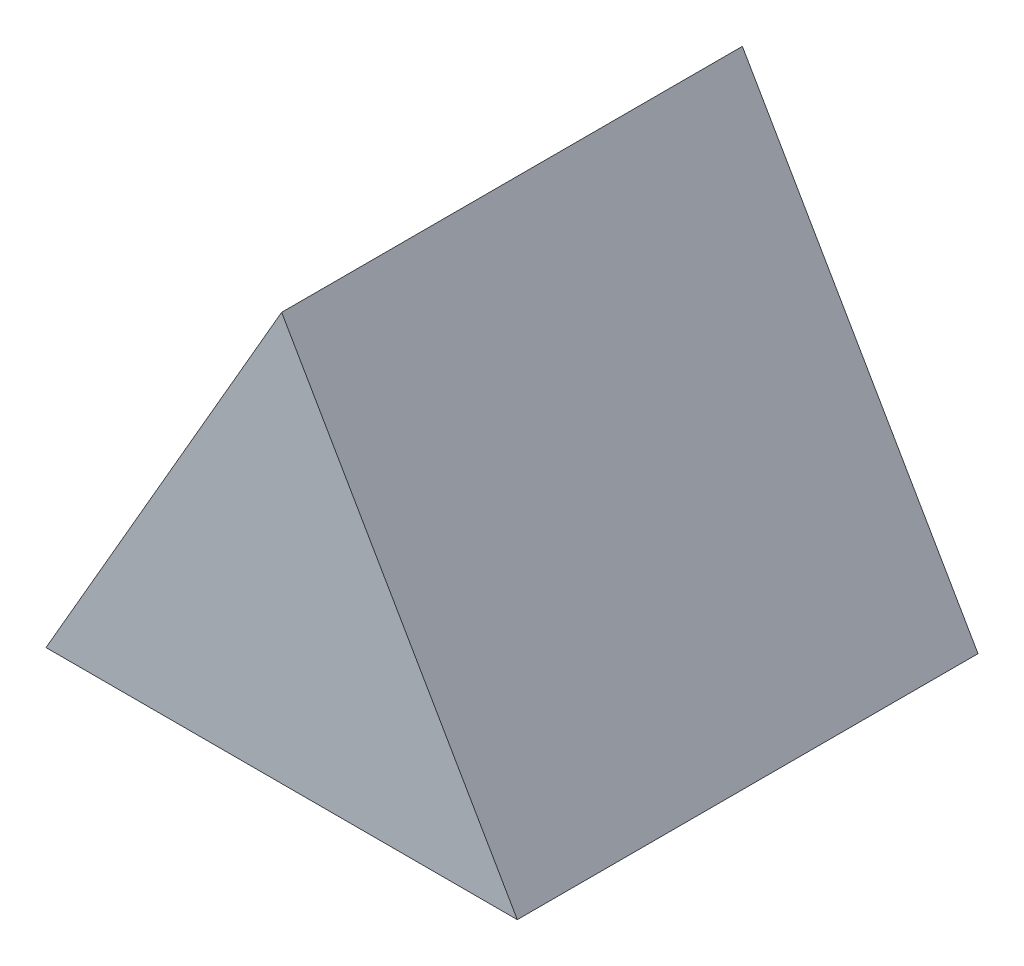
ISO-10303-21;
HEADER;
FILE_DESCRIPTION(('STEP AP214'),'2;1');
FILE_NAME('part.step','',(''),(''),'','','');
FILE_SCHEMA(('AUTOMOTIVE_DESIGN { 1 0 10303 214 1 1 1 1 }'));
ENDSEC;
DATA;
#1=APPLICATION_CONTEXT('core data for automotive mechanical design processes');
#2=APPLICATION_PROTOCOL_DEFINITION('international standard','automotive_design',2000,#1);
#3=PRODUCT_CONTEXT('',#1,'mechanical');
#4=PRODUCT('Part','Part','',(#3));
#5=PRODUCT_RELATED_PRODUCT_CATEGORY('part','',(#4));
#6=PRODUCT_DEFINITION_FORMATION('','',#4);
#7=PRODUCT_DEFINITION_CONTEXT('part definition',#1,'design');
#8=PRODUCT_DEFINITION('design','',#6,#7);
#9=PRODUCT_DEFINITION_SHAPE('','',#8);
#10=(LENGTH_UNIT() NAMED_UNIT(*) SI_UNIT(.MILLI.,.METRE.));
#11=(NAMED_UNIT(*) PLANE_ANGLE_UNIT() SI_UNIT($,.RADIAN.));
#12=(NAMED_UNIT(*) SI_UNIT($,.STERADIAN.) SOLID_ANGLE_UNIT());
#13=UNCERTAINTY_MEASURE_WITH_UNIT(LENGTH_MEASURE(1.E-05),#10,'distance_accuracy_value','');
#14=(GEOMETRIC_REPRESENTATION_CONTEXT(3) GLOBAL_UNCERTAINTY_ASSIGNED_CONTEXT((#13)) GLOBAL_UNIT_ASSIGNED_CONTEXT((#10,
#11,#12)) REPRESENTATION_CONTEXT('',''));
#15=CARTESIAN_POINT('',(0.,0.,0.));
#16=DIRECTION('',(0.,0.,1.));
#17=DIRECTION('',(1.,0.,0.));
#18=AXIS2_PLACEMENT_3D('',#15,#16,#17);
#19=CARTESIAN_POINT('',(81.8394006576308,-47.2499999999992,160.));
#20=DIRECTION('',(-0.866025403784434,-0.500000000000008,0.));
#21=DIRECTION('',(0.500000000000008,-0.866025403784434,0.));
#22=AXIS2_PLACEMENT_3D('',#19,#20,#21);
#23=PLANE('',#22);
#24=DIRECTION('',(-0.500000000000008,0.866025403784434,0.));
#25=VECTOR('',#24,1.);
#26=CARTESIAN_POINT('',(81.8394006576308,-47.2499999999992,0.));
#27=LINE('',#26,#25);
#28=CARTESIAN_POINT('',(81.8394006576308,-47.2499999999992,0.));
#29=VERTEX_POINT('',#28);
#30=CARTESIAN_POINT('',(0.,94.5,0.));
#31=VERTEX_POINT('',#30);
#32=EDGE_CURVE('E80',#29,#31,#27,.T.);
#33=ORIENTED_EDGE('',*,*,#32,.T.);
#34=DIRECTION('',(0.,0.,-1.));
#35=VECTOR('',#34,1.);
#36=CARTESIAN_POINT('',(0.,94.5,160.));
#37=LINE('',#36,#35);
#38=CARTESIAN_POINT('',(0.,94.5,160.));
#39=VERTEX_POINT('',#38);
#40=EDGE_CURVE('E11',#39,#31,#37,.T.);
#41=ORIENTED_EDGE('',*,*,#40,.F.);
#42=DIRECTION('',(-0.500000000000008,0.866025403784434,0.));
#43=VECTOR('',#42,1.);
#44=CARTESIAN_POINT('',(81.8394006576308,-47.2499999999992,160.));
#45=LINE('',#44,#43);
#46=CARTESIAN_POINT('',(81.8394006576308,-47.2499999999992,160.));
#47=VERTEX_POINT('',#46);
#48=EDGE_CURVE('E73',#47,#39,#45,.T.);
#49=ORIENTED_EDGE('',*,*,#48,.F.);
#50=DIRECTION('',(0.,0.,-1.));
#51=VECTOR('',#50,1.);
#52=CARTESIAN_POINT('',(81.8394006576308,-47.2499999999992,160.));
#53=LINE('',#52,#51);
#54=EDGE_CURVE('E81',#47,#29,#53,.T.);
#55=ORIENTED_EDGE('',*,*,#54,.T.);
#56=EDGE_LOOP('',(#33,#41,#49,#55));
#57=FACE_BOUND('',#56,.T.);
#58=ADVANCED_FACE('F33',(#57),#23,.F.);
#59=CARTESIAN_POINT('',(0.,94.5,160.));
#60=DIRECTION('',(0.86602540378444,-0.499999999999998,0.));
#61=DIRECTION('',(0.499999999999998,0.86602540378444,0.));
#62=AXIS2_PLACEMENT_3D('',#59,#60,#61);
#63=PLANE('',#62);
#64=DIRECTION('',(-0.499999999999998,-0.86602540378444,0.));
#65=VECTOR('',#64,1.);
#66=CARTESIAN_POINT('',(0.,94.5,0.));
#67=LINE('',#66,#65);
#68=CARTESIAN_POINT('',(-81.8394006576292,-47.2500000000004,0.));
#69=VERTEX_POINT('',#68);
#70=EDGE_CURVE('E61',#31,#69,#67,.T.);
#71=ORIENTED_EDGE('',*,*,#70,.T.);
#72=DIRECTION('',(0.,0.,-1.));
#73=VECTOR('',#72,1.);
#74=CARTESIAN_POINT('',(-81.8394006576292,-47.2500000000004,160.));
#75=LINE('',#74,#73);
#76=CARTESIAN_POINT('',(-81.8394006576292,-47.2500000000004,160.));
#77=VERTEX_POINT('',#76);
#78=EDGE_CURVE('E41',#77,#69,#75,.T.);
#79=ORIENTED_EDGE('',*,*,#78,.F.);
#80=DIRECTION('',(-0.499999999999998,-0.86602540378444,0.));
#81=VECTOR('',#80,1.);
#82=CARTESIAN_POINT('',(0.,94.5,160.));
#83=LINE('',#82,#81);
#84=EDGE_CURVE('E69',#39,#77,#83,.T.);
#85=ORIENTED_EDGE('',*,*,#84,.F.);
#86=ORIENTED_EDGE('',*,*,#40,.T.);
#87=EDGE_LOOP('',(#71,#79,#85,#86));
#88=FACE_BOUND('',#87,.T.);
#89=ADVANCED_FACE('F70',(#88),#63,.F.);
#90=CARTESIAN_POINT('',(-81.8394006576292,-47.2500000000004,160.));
#91=DIRECTION('',(0.,1.,0.));
#92=DIRECTION('',(-1.,0.,0.));
#93=AXIS2_PLACEMENT_3D('',#90,#91,#92);
#94=PLANE('',#93);
#95=DIRECTION('',(1.,0.,0.));
#96=VECTOR('',#95,1.);
#97=CARTESIAN_POINT('',(-81.8394006576292,-47.2500000000004,0.));
#98=LINE('',#97,#96);
#99=EDGE_CURVE('E66',#69,#29,#98,.T.);
#100=ORIENTED_EDGE('',*,*,#99,.T.);
#101=ORIENTED_EDGE('',*,*,#54,.F.);
#102=DIRECTION('',(1.,0.,0.));
#103=VECTOR('',#102,1.);
#104=CARTESIAN_POINT('',(-81.8394006576292,-47.2500000000004,160.));
#105=LINE('',#104,#103);
#106=EDGE_CURVE('E49',#77,#47,#105,.T.);
#107=ORIENTED_EDGE('',*,*,#106,.F.);
#108=ORIENTED_EDGE('',*,*,#78,.T.);
#109=EDGE_LOOP('',(#100,#101,#107,#108));
#110=FACE_BOUND('',#109,.T.);
#111=ADVANCED_FACE('F88',(#110),#94,.F.);
#112=CARTESIAN_POINT('',(0.,0.,160.));
#113=DIRECTION('',(0.,0.,1.));
#114=DIRECTION('',(1.,0.,0.));
#115=AXIS2_PLACEMENT_3D('',#112,#113,#114);
#116=PLANE('',#115);
#117=ORIENTED_EDGE('',*,*,#48,.T.);
#118=ORIENTED_EDGE('',*,*,#84,.T.);
#119=ORIENTED_EDGE('',*,*,#106,.T.);
#120=EDGE_LOOP('',(#117,#118,#119));
#121=FACE_BOUND('',#120,.T.);
#122=ADVANCED_FACE('F76',(#121),#116,.T.);
#123=CARTESIAN_POINT('',(0.,0.,0.));
#124=DIRECTION('',(0.,0.,1.));
#125=DIRECTION('',(1.,0.,0.));
#126=AXIS2_PLACEMENT_3D('',#123,#124,#125);
#127=PLANE('',#126);
#128=ORIENTED_EDGE('',*,*,#32,.F.);
#129=ORIENTED_EDGE('',*,*,#99,.F.);
#130=ORIENTED_EDGE('',*,*,#70,.F.);
#131=EDGE_LOOP('',(#128,#129,#130));
#132=FACE_BOUND('',#131,.T.);
#133=ADVANCED_FACE('F89',(#132),#127,.F.);
#134=CLOSED_SHELL('',(#58,#89,#111,#122,#133));
#135=MANIFOLD_SOLID_BREP('B2',#134);
#136=ADVANCED_BREP_SHAPE_REPRESENTATION('',(#18,#135),#14);
#137=SHAPE_DEFINITION_REPRESENTATION(#9,#136);
ENDSEC;
END-ISO-10303-21;
